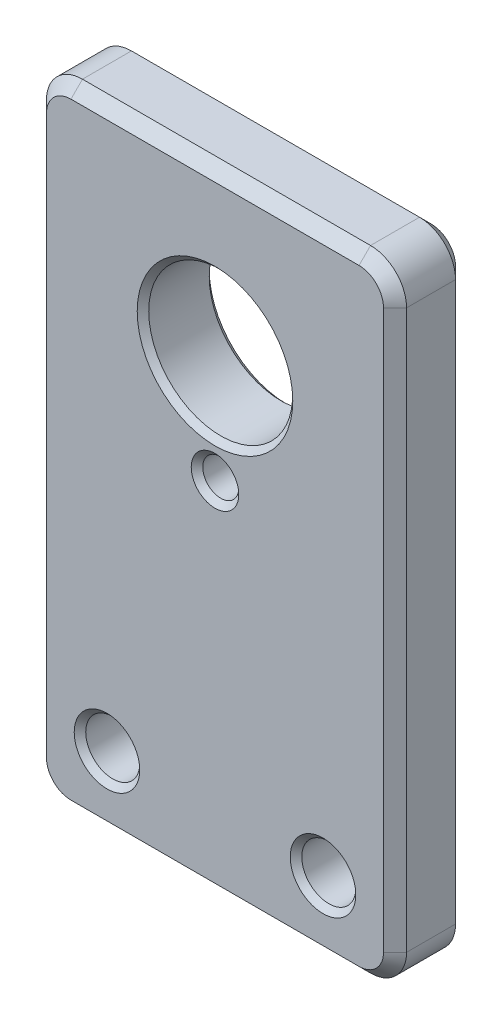
ISO-10303-21;
HEADER;
FILE_DESCRIPTION(('STEP AP214'),'2;1');
FILE_NAME('part.step','',(''),(''),'','','');
FILE_SCHEMA(('AUTOMOTIVE_DESIGN { 1 0 10303 214 1 1 1 1 }'));
ENDSEC;
DATA;
#1=APPLICATION_CONTEXT('core data for automotive mechanical design processes');
#2=APPLICATION_PROTOCOL_DEFINITION('international standard','automotive_design',2000,#1);
#3=PRODUCT_CONTEXT('',#1,'mechanical');
#4=PRODUCT('Part','Part','',(#3));
#5=PRODUCT_RELATED_PRODUCT_CATEGORY('part','',(#4));
#6=PRODUCT_DEFINITION_FORMATION('','',#4);
#7=PRODUCT_DEFINITION_CONTEXT('part definition',#1,'design');
#8=PRODUCT_DEFINITION('design','',#6,#7);
#9=PRODUCT_DEFINITION_SHAPE('','',#8);
#10=(LENGTH_UNIT() NAMED_UNIT(*) SI_UNIT(.MILLI.,.METRE.));
#11=(NAMED_UNIT(*) PLANE_ANGLE_UNIT() SI_UNIT($,.RADIAN.));
#12=(NAMED_UNIT(*) SI_UNIT($,.STERADIAN.) SOLID_ANGLE_UNIT());
#13=UNCERTAINTY_MEASURE_WITH_UNIT(LENGTH_MEASURE(1.E-05),#10,'distance_accuracy_value','');
#14=(GEOMETRIC_REPRESENTATION_CONTEXT(3) GLOBAL_UNCERTAINTY_ASSIGNED_CONTEXT((#13)) GLOBAL_UNIT_ASSIGNED_CONTEXT((#10,
#11,#12)) REPRESENTATION_CONTEXT('',''));
#15=CARTESIAN_POINT('',(0.,0.,0.));
#16=DIRECTION('',(0.,0.,1.));
#17=DIRECTION('',(1.,0.,0.));
#18=AXIS2_PLACEMENT_3D('',#15,#16,#17);
#19=CARTESIAN_POINT('',(-7.9375,-13.890625,1.5875));
#20=DIRECTION('',(-1.,0.,0.));
#21=DIRECTION('',(0.,0.,1.));
#22=AXIS2_PLACEMENT_3D('',#19,#20,#21);
#23=PLANE('',#22);
#24=DIRECTION('',(0.,0.,-1.));
#25=VECTOR('',#24,1.);
#26=CARTESIAN_POINT('',(-7.9375,12.303125,1.5875));
#27=LINE('',#26,#25);
#28=CARTESIAN_POINT('',(-7.9375,12.303125,1.0795));
#29=VERTEX_POINT('',#28);
#30=CARTESIAN_POINT('',(-7.9375,12.303125,-1.0795));
#31=VERTEX_POINT('',#30);
#32=EDGE_CURVE('E189',#29,#31,#27,.T.);
#33=ORIENTED_EDGE('',*,*,#32,.T.);
#34=DIRECTION('',(0.,-1.,0.));
#35=VECTOR('',#34,1.);
#36=CARTESIAN_POINT('',(-7.9375,-13.890625,-1.0795));
#37=LINE('',#36,#35);
#38=CARTESIAN_POINT('',(-7.9375,-12.303125,-1.0795));
#39=VERTEX_POINT('',#38);
#40=EDGE_CURVE('E227',#31,#39,#37,.T.);
#41=ORIENTED_EDGE('',*,*,#40,.T.);
#42=DIRECTION('',(0.,0.,-1.));
#43=VECTOR('',#42,1.);
#44=CARTESIAN_POINT('',(-7.9375,-12.303125,1.5875));
#45=LINE('',#44,#43);
#46=CARTESIAN_POINT('',(-7.9375,-12.303125,1.0795));
#47=VERTEX_POINT('',#46);
#48=EDGE_CURVE('E192',#39,#47,#45,.F.);
#49=ORIENTED_EDGE('',*,*,#48,.T.);
#50=DIRECTION('',(0.,1.,0.));
#51=VECTOR('',#50,1.);
#52=CARTESIAN_POINT('',(-7.9375,12.303125,1.0795));
#53=LINE('',#52,#51);
#54=EDGE_CURVE('E172',#47,#29,#53,.T.);
#55=ORIENTED_EDGE('',*,*,#54,.T.);
#56=EDGE_LOOP('',(#33,#41,#49,#55));
#57=FACE_BOUND('',#56,.T.);
#58=ADVANCED_FACE('F34',(#57),#23,.T.);
#59=CARTESIAN_POINT('',(-7.9375,-13.890625,1.5875));
#60=DIRECTION('',(0.,1.,0.));
#61=DIRECTION('',(0.,0.,1.));
#62=AXIS2_PLACEMENT_3D('',#59,#60,#61);
#63=PLANE('',#62);
#64=DIRECTION('',(0.,0.,-1.));
#65=VECTOR('',#64,1.);
#66=CARTESIAN_POINT('',(-6.35,-13.890625,-1.5875));
#67=LINE('',#66,#65);
#68=CARTESIAN_POINT('',(-6.35,-13.890625,1.0795));
#69=VERTEX_POINT('',#68);
#70=CARTESIAN_POINT('',(-6.35,-13.890625,-1.0795));
#71=VERTEX_POINT('',#70);
#72=EDGE_CURVE('E182',#69,#71,#67,.T.);
#73=ORIENTED_EDGE('',*,*,#72,.T.);
#74=DIRECTION('',(1.,0.,0.));
#75=VECTOR('',#74,1.);
#76=CARTESIAN_POINT('',(6.35,-13.890625,-1.0795));
#77=LINE('',#76,#75);
#78=CARTESIAN_POINT('',(6.35,-13.890625,-1.0795));
#79=VERTEX_POINT('',#78);
#80=EDGE_CURVE('E155',#71,#79,#77,.T.);
#81=ORIENTED_EDGE('',*,*,#80,.T.);
#82=DIRECTION('',(0.,0.,-1.));
#83=VECTOR('',#82,1.);
#84=CARTESIAN_POINT('',(6.35,-13.890625,1.5875));
#85=LINE('',#84,#83);
#86=CARTESIAN_POINT('',(6.35,-13.890625,1.0795));
#87=VERTEX_POINT('',#86);
#88=EDGE_CURVE('E180',#79,#87,#85,.F.);
#89=ORIENTED_EDGE('',*,*,#88,.T.);
#90=DIRECTION('',(-1.,0.,0.));
#91=VECTOR('',#90,1.);
#92=CARTESIAN_POINT('',(-7.9375,-13.890625,1.0795));
#93=LINE('',#92,#91);
#94=EDGE_CURVE('E185',#87,#69,#93,.T.);
#95=ORIENTED_EDGE('',*,*,#94,.T.);
#96=EDGE_LOOP('',(#73,#81,#89,#95));
#97=FACE_BOUND('',#96,.T.);
#98=ADVANCED_FACE('F178',(#97),#63,.F.);
#99=CARTESIAN_POINT('',(7.9375,-13.890625,1.5875));
#100=DIRECTION('',(-1.,0.,0.));
#101=DIRECTION('',(0.,0.,1.));
#102=AXIS2_PLACEMENT_3D('',#99,#100,#101);
#103=PLANE('',#102);
#104=DIRECTION('',(0.,0.,-1.));
#105=VECTOR('',#104,1.);
#106=CARTESIAN_POINT('',(7.9375,-12.303125,1.5875));
#107=LINE('',#106,#105);
#108=CARTESIAN_POINT('',(7.9375,-12.303125,1.0795));
#109=VERTEX_POINT('',#108);
#110=CARTESIAN_POINT('',(7.9375,-12.303125,-1.0795));
#111=VERTEX_POINT('',#110);
#112=EDGE_CURVE('E194',#109,#111,#107,.T.);
#113=ORIENTED_EDGE('',*,*,#112,.T.);
#114=DIRECTION('',(0.,1.,0.));
#115=VECTOR('',#114,1.);
#116=CARTESIAN_POINT('',(7.9375,12.303125,-1.0795));
#117=LINE('',#116,#115);
#118=CARTESIAN_POINT('',(7.9375,12.303125,-1.0795));
#119=VERTEX_POINT('',#118);
#120=EDGE_CURVE('E231',#111,#119,#117,.T.);
#121=ORIENTED_EDGE('',*,*,#120,.T.);
#122=DIRECTION('',(0.,0.,-1.));
#123=VECTOR('',#122,1.);
#124=CARTESIAN_POINT('',(7.9375,12.303125,1.5875));
#125=LINE('',#124,#123);
#126=CARTESIAN_POINT('',(7.9375,12.303125,1.0795));
#127=VERTEX_POINT('',#126);
#128=EDGE_CURVE('E278',#119,#127,#125,.F.);
#129=ORIENTED_EDGE('',*,*,#128,.T.);
#130=DIRECTION('',(0.,-1.,0.));
#131=VECTOR('',#130,1.);
#132=CARTESIAN_POINT('',(7.9375,-13.890625,1.0795));
#133=LINE('',#132,#131);
#134=EDGE_CURVE('E229',#127,#109,#133,.T.);
#135=ORIENTED_EDGE('',*,*,#134,.T.);
#136=EDGE_LOOP('',(#113,#121,#129,#135));
#137=FACE_BOUND('',#136,.T.);
#138=ADVANCED_FACE('F365',(#137),#103,.F.);
#139=CARTESIAN_POINT('',(-7.9375,13.890625,1.5875));
#140=DIRECTION('',(0.,1.,0.));
#141=DIRECTION('',(0.,0.,1.));
#142=AXIS2_PLACEMENT_3D('',#139,#140,#141);
#143=PLANE('',#142);
#144=DIRECTION('',(0.,0.,-1.));
#145=VECTOR('',#144,1.);
#146=CARTESIAN_POINT('',(6.35,13.890625,-1.5875));
#147=LINE('',#146,#145);
#148=CARTESIAN_POINT('',(6.35,13.890625,1.0795));
#149=VERTEX_POINT('',#148);
#150=CARTESIAN_POINT('',(6.35,13.890625,-1.0795));
#151=VERTEX_POINT('',#150);
#152=EDGE_CURVE('E200',#149,#151,#147,.T.);
#153=ORIENTED_EDGE('',*,*,#152,.T.);
#154=DIRECTION('',(-1.,0.,0.));
#155=VECTOR('',#154,1.);
#156=CARTESIAN_POINT('',(-7.9375,13.890625,-1.0795));
#157=LINE('',#156,#155);
#158=CARTESIAN_POINT('',(-6.35,13.890625,-1.0795));
#159=VERTEX_POINT('',#158);
#160=EDGE_CURVE('E243',#151,#159,#157,.T.);
#161=ORIENTED_EDGE('',*,*,#160,.T.);
#162=DIRECTION('',(0.,0.,-1.));
#163=VECTOR('',#162,1.);
#164=CARTESIAN_POINT('',(-6.35,13.890625,1.5875));
#165=LINE('',#164,#163);
#166=CARTESIAN_POINT('',(-6.35,13.890625,1.0795));
#167=VERTEX_POINT('',#166);
#168=EDGE_CURVE('E203',#159,#167,#165,.F.);
#169=ORIENTED_EDGE('',*,*,#168,.T.);
#170=DIRECTION('',(1.,0.,0.));
#171=VECTOR('',#170,1.);
#172=CARTESIAN_POINT('',(6.35,13.890625,1.0795));
#173=LINE('',#172,#171);
#174=EDGE_CURVE('E241',#167,#149,#173,.T.);
#175=ORIENTED_EDGE('',*,*,#174,.T.);
#176=EDGE_LOOP('',(#153,#161,#169,#175));
#177=FACE_BOUND('',#176,.T.);
#178=ADVANCED_FACE('F384',(#177),#143,.T.);
#179=CARTESIAN_POINT('',(0.,0.,1.5875));
#180=DIRECTION('',(0.,0.,-1.));
#181=DIRECTION('',(-1.,0.,0.));
#182=AXIS2_PLACEMENT_3D('',#179,#180,#181);
#183=PLANE('',#182);
#184=CARTESIAN_POINT('',(4.7625,-10.715625,1.5875));
#185=DIRECTION('',(0.,0.,-1.));
#186=DIRECTION('',(-1.,0.,0.));
#187=AXIS2_PLACEMENT_3D('',#184,#185,#186);
#188=CIRCLE('',#187,1.444625);
#189=CARTESIAN_POINT('',(3.317875,-10.715625,1.5875));
#190=VERTEX_POINT('',#189);
#191=EDGE_CURVE('E313',#190,#190,#188,.T.);
#192=ORIENTED_EDGE('',*,*,#191,.T.);
#193=EDGE_LOOP('',(#192));
#194=FACE_BOUND('',#193,.T.);
#195=CARTESIAN_POINT('',(-4.7625,-10.715625,1.5875));
#196=DIRECTION('',(0.,0.,-1.));
#197=DIRECTION('',(-1.,0.,0.));
#198=AXIS2_PLACEMENT_3D('',#195,#196,#197);
#199=CIRCLE('',#198,1.444625);
#200=CARTESIAN_POINT('',(-6.207125,-10.715625,1.5875));
#201=VERTEX_POINT('',#200);
#202=EDGE_CURVE('E310',#201,#201,#199,.T.);
#203=ORIENTED_EDGE('',*,*,#202,.T.);
#204=EDGE_LOOP('',(#203));
#205=FACE_BOUND('',#204,.T.);
#206=CARTESIAN_POINT('',(0.,1.984375,1.5875));
#207=DIRECTION('',(0.,0.,-1.));
#208=DIRECTION('',(-1.,0.,0.));
#209=AXIS2_PLACEMENT_3D('',#206,#207,#208);
#210=CIRCLE('',#209,1.04775);
#211=CARTESIAN_POINT('',(-1.04775,1.984375,1.5875));
#212=VERTEX_POINT('',#211);
#213=EDGE_CURVE('E307',#212,#212,#210,.T.);
#214=ORIENTED_EDGE('',*,*,#213,.T.);
#215=EDGE_LOOP('',(#214));
#216=FACE_BOUND('',#215,.T.);
#217=CARTESIAN_POINT('',(0.,6.746875,1.5875));
#218=DIRECTION('',(0.,0.,-1.));
#219=DIRECTION('',(-1.,0.,0.));
#220=AXIS2_PLACEMENT_3D('',#217,#218,#219);
#221=CIRCLE('',#220,3.42900000000001);
#222=CARTESIAN_POINT('',(-3.42900000000001,6.746875,1.5875));
#223=VERTEX_POINT('',#222);
#224=EDGE_CURVE('E304',#223,#223,#221,.T.);
#225=ORIENTED_EDGE('',*,*,#224,.T.);
#226=EDGE_LOOP('',(#225));
#227=FACE_BOUND('',#226,.T.);
#228=CARTESIAN_POINT('',(-6.35,-12.303125,1.5875));
#229=DIRECTION('',(0.,0.,-1.));
#230=DIRECTION('',(-1.,0.,0.));
#231=AXIS2_PLACEMENT_3D('',#228,#229,#230);
#232=CIRCLE('',#231,1.0795);
#233=CARTESIAN_POINT('',(-7.42950000000001,-12.303125,1.5875));
#234=VERTEX_POINT('',#233);
#235=CARTESIAN_POINT('',(-6.35,-13.382625,1.5875));
#236=VERTEX_POINT('',#235);
#237=EDGE_CURVE('E49',#234,#236,#232,.F.);
#238=ORIENTED_EDGE('',*,*,#237,.T.);
#239=DIRECTION('',(1.,0.,0.));
#240=VECTOR('',#239,1.);
#241=CARTESIAN_POINT('',(0.,-13.382625,1.5875));
#242=LINE('',#241,#240);
#243=CARTESIAN_POINT('',(6.35,-13.382625,1.5875));
#244=VERTEX_POINT('',#243);
#245=EDGE_CURVE('E258',#236,#244,#242,.T.);
#246=ORIENTED_EDGE('',*,*,#245,.T.);
#247=CARTESIAN_POINT('',(6.35,-12.303125,1.5875));
#248=DIRECTION('',(0.,0.,-1.));
#249=DIRECTION('',(-1.,0.,0.));
#250=AXIS2_PLACEMENT_3D('',#247,#248,#249);
#251=CIRCLE('',#250,1.0795);
#252=CARTESIAN_POINT('',(7.4295,-12.303125,1.5875));
#253=VERTEX_POINT('',#252);
#254=EDGE_CURVE('E255',#244,#253,#251,.F.);
#255=ORIENTED_EDGE('',*,*,#254,.T.);
#256=DIRECTION('',(0.,1.,0.));
#257=VECTOR('',#256,1.);
#258=CARTESIAN_POINT('',(7.4295,0.,1.5875));
#259=LINE('',#258,#257);
#260=CARTESIAN_POINT('',(7.4295,12.303125,1.5875));
#261=VERTEX_POINT('',#260);
#262=EDGE_CURVE('E251',#253,#261,#259,.T.);
#263=ORIENTED_EDGE('',*,*,#262,.T.);
#264=CARTESIAN_POINT('',(6.35,12.303125,1.5875));
#265=DIRECTION('',(0.,0.,-1.));
#266=DIRECTION('',(-1.,0.,0.));
#267=AXIS2_PLACEMENT_3D('',#264,#265,#266);
#268=CIRCLE('',#267,1.0795);
#269=CARTESIAN_POINT('',(6.35,13.382625,1.5875));
#270=VERTEX_POINT('',#269);
#271=EDGE_CURVE('E247',#261,#270,#268,.F.);
#272=ORIENTED_EDGE('',*,*,#271,.T.);
#273=DIRECTION('',(-1.,0.,0.));
#274=VECTOR('',#273,1.);
#275=CARTESIAN_POINT('',(-6.35,13.382625,1.5875));
#276=LINE('',#275,#274);
#277=CARTESIAN_POINT('',(-6.35,13.382625,1.5875));
#278=VERTEX_POINT('',#277);
#279=EDGE_CURVE('E245',#270,#278,#276,.T.);
#280=ORIENTED_EDGE('',*,*,#279,.T.);
#281=CARTESIAN_POINT('',(-6.35,12.303125,1.5875));
#282=DIRECTION('',(0.,0.,-1.));
#283=DIRECTION('',(-1.,0.,0.));
#284=AXIS2_PLACEMENT_3D('',#281,#282,#283);
#285=CIRCLE('',#284,1.0795);
#286=CARTESIAN_POINT('',(-7.42950000000001,12.303125,1.5875));
#287=VERTEX_POINT('',#286);
#288=EDGE_CURVE('E249',#278,#287,#285,.F.);
#289=ORIENTED_EDGE('',*,*,#288,.T.);
#290=DIRECTION('',(0.,-1.,0.));
#291=VECTOR('',#290,1.);
#292=CARTESIAN_POINT('',(-7.42950000000001,-12.303125,1.5875));
#293=LINE('',#292,#291);
#294=EDGE_CURVE('E253',#287,#234,#293,.T.);
#295=ORIENTED_EDGE('',*,*,#294,.T.);
#296=EDGE_LOOP('',(#238,#246,#255,#263,#272,#280,#289,#295));
#297=FACE_BOUND('',#296,.T.);
#298=ADVANCED_FACE('F353',(#194,#205,#216,#227,#297),#183,.F.);
#299=CARTESIAN_POINT('',(0.,0.,-1.5875));
#300=DIRECTION('',(0.,0.,-1.));
#301=DIRECTION('',(-1.,0.,0.));
#302=AXIS2_PLACEMENT_3D('',#299,#300,#301);
#303=PLANE('',#302);
#304=CARTESIAN_POINT('',(4.7625,-10.715625,-1.5875));
#305=DIRECTION('',(0.,0.,-1.));
#306=DIRECTION('',(-1.,0.,0.));
#307=AXIS2_PLACEMENT_3D('',#304,#305,#306);
#308=CIRCLE('',#307,1.444625);
#309=CARTESIAN_POINT('',(3.317875,-10.715625,-1.5875));
#310=VERTEX_POINT('',#309);
#311=EDGE_CURVE('E325',#310,#310,#308,.F.);
#312=ORIENTED_EDGE('',*,*,#311,.T.);
#313=EDGE_LOOP('',(#312));
#314=FACE_BOUND('',#313,.T.);
#315=CARTESIAN_POINT('',(-4.7625,-10.715625,-1.5875));
#316=DIRECTION('',(0.,0.,-1.));
#317=DIRECTION('',(-1.,0.,0.));
#318=AXIS2_PLACEMENT_3D('',#315,#316,#317);
#319=CIRCLE('',#318,1.444625);
#320=CARTESIAN_POINT('',(-6.207125,-10.715625,-1.5875));
#321=VERTEX_POINT('',#320);
#322=EDGE_CURVE('E322',#321,#321,#319,.F.);
#323=ORIENTED_EDGE('',*,*,#322,.T.);
#324=EDGE_LOOP('',(#323));
#325=FACE_BOUND('',#324,.T.);
#326=CARTESIAN_POINT('',(0.,1.984375,-1.5875));
#327=DIRECTION('',(0.,0.,-1.));
#328=DIRECTION('',(-1.,0.,0.));
#329=AXIS2_PLACEMENT_3D('',#326,#327,#328);
#330=CIRCLE('',#329,1.04774999999999);
#331=CARTESIAN_POINT('',(-1.04774999999999,1.984375,-1.5875));
#332=VERTEX_POINT('',#331);
#333=EDGE_CURVE('E319',#332,#332,#330,.F.);
#334=ORIENTED_EDGE('',*,*,#333,.T.);
#335=EDGE_LOOP('',(#334));
#336=FACE_BOUND('',#335,.T.);
#337=CARTESIAN_POINT('',(0.,6.746875,-1.5875));
#338=DIRECTION('',(0.,0.,-1.));
#339=DIRECTION('',(-1.,0.,0.));
#340=AXIS2_PLACEMENT_3D('',#337,#338,#339);
#341=CIRCLE('',#340,3.429);
#342=CARTESIAN_POINT('',(-3.429,6.746875,-1.5875));
#343=VERTEX_POINT('',#342);
#344=EDGE_CURVE('E316',#343,#343,#341,.F.);
#345=ORIENTED_EDGE('',*,*,#344,.T.);
#346=EDGE_LOOP('',(#345));
#347=FACE_BOUND('',#346,.T.);
#348=CARTESIAN_POINT('',(6.35,-12.303125,-1.5875));
#349=DIRECTION('',(0.,0.,-1.));
#350=DIRECTION('',(-1.,0.,0.));
#351=AXIS2_PLACEMENT_3D('',#348,#349,#350);
#352=CIRCLE('',#351,1.0795);
#353=CARTESIAN_POINT('',(7.4295,-12.303125,-1.5875));
#354=VERTEX_POINT('',#353);
#355=CARTESIAN_POINT('',(6.35,-13.382625,-1.5875));
#356=VERTEX_POINT('',#355);
#357=EDGE_CURVE('E216',#354,#356,#352,.T.);
#358=ORIENTED_EDGE('',*,*,#357,.T.);
#359=DIRECTION('',(-1.,0.,0.));
#360=VECTOR('',#359,1.);
#361=CARTESIAN_POINT('',(-6.35,-13.382625,-1.5875));
#362=LINE('',#361,#360);
#363=CARTESIAN_POINT('',(-6.35,-13.382625,-1.5875));
#364=VERTEX_POINT('',#363);
#365=EDGE_CURVE('E157',#356,#364,#362,.T.);
#366=ORIENTED_EDGE('',*,*,#365,.T.);
#367=CARTESIAN_POINT('',(-6.35,-12.303125,-1.5875));
#368=DIRECTION('',(0.,0.,-1.));
#369=DIRECTION('',(-1.,0.,0.));
#370=AXIS2_PLACEMENT_3D('',#367,#368,#369);
#371=CIRCLE('',#370,1.0795);
#372=CARTESIAN_POINT('',(-7.42950000000001,-12.303125,-1.5875));
#373=VERTEX_POINT('',#372);
#374=EDGE_CURVE('E218',#364,#373,#371,.T.);
#375=ORIENTED_EDGE('',*,*,#374,.T.);
#376=DIRECTION('',(0.,1.,0.));
#377=VECTOR('',#376,1.);
#378=CARTESIAN_POINT('',(-7.42950000000001,0.,-1.5875));
#379=LINE('',#378,#377);
#380=CARTESIAN_POINT('',(-7.42950000000001,12.303125,-1.5875));
#381=VERTEX_POINT('',#380);
#382=EDGE_CURVE('E214',#373,#381,#379,.T.);
#383=ORIENTED_EDGE('',*,*,#382,.T.);
#384=CARTESIAN_POINT('',(-6.35,12.303125,-1.5875));
#385=DIRECTION('',(0.,0.,-1.));
#386=DIRECTION('',(-1.,0.,0.));
#387=AXIS2_PLACEMENT_3D('',#384,#385,#386);
#388=CIRCLE('',#387,1.0795);
#389=CARTESIAN_POINT('',(-6.35,13.382625,-1.5875));
#390=VERTEX_POINT('',#389);
#391=EDGE_CURVE('E210',#381,#390,#388,.T.);
#392=ORIENTED_EDGE('',*,*,#391,.T.);
#393=DIRECTION('',(1.,0.,0.));
#394=VECTOR('',#393,1.);
#395=CARTESIAN_POINT('',(0.,13.382625,-1.5875));
#396=LINE('',#395,#394);
#397=CARTESIAN_POINT('',(6.35,13.382625,-1.5875));
#398=VERTEX_POINT('',#397);
#399=EDGE_CURVE('E184',#390,#398,#396,.T.);
#400=ORIENTED_EDGE('',*,*,#399,.T.);
#401=CARTESIAN_POINT('',(6.35,12.303125,-1.5875));
#402=DIRECTION('',(0.,0.,-1.));
#403=DIRECTION('',(-1.,0.,0.));
#404=AXIS2_PLACEMENT_3D('',#401,#402,#403);
#405=CIRCLE('',#404,1.0795);
#406=CARTESIAN_POINT('',(7.4295,12.303125,-1.5875));
#407=VERTEX_POINT('',#406);
#408=EDGE_CURVE('E208',#398,#407,#405,.T.);
#409=ORIENTED_EDGE('',*,*,#408,.T.);
#410=DIRECTION('',(0.,-1.,0.));
#411=VECTOR('',#410,1.);
#412=CARTESIAN_POINT('',(7.4295,-12.303125,-1.5875));
#413=LINE('',#412,#411);
#414=EDGE_CURVE('E212',#407,#354,#413,.T.);
#415=ORIENTED_EDGE('',*,*,#414,.T.);
#416=EDGE_LOOP('',(#358,#366,#375,#383,#392,#400,#409,#415));
#417=FACE_BOUND('',#416,.T.);
#418=ADVANCED_FACE('F349',(#314,#325,#336,#347,#417),#303,.T.);
#419=CARTESIAN_POINT('',(4.7625,-10.715625,1.5875));
#420=DIRECTION('',(0.,0.,1.));
#421=DIRECTION('',(1.,0.,0.));
#422=AXIS2_PLACEMENT_3D('',#419,#420,#421);
#423=CYLINDRICAL_SURFACE('',#422,1.190625);
#424=CARTESIAN_POINT('',(4.7625,-10.715625,1.3335));
#425=DIRECTION('',(0.,0.,-1.));
#426=DIRECTION('',(-1.,0.,0.));
#427=AXIS2_PLACEMENT_3D('',#424,#425,#426);
#428=CIRCLE('',#427,1.190625);
#429=CARTESIAN_POINT('',(3.571875,-10.715625,1.3335));
#430=VERTEX_POINT('',#429);
#431=EDGE_CURVE('E301',#430,#430,#428,.F.);
#432=ORIENTED_EDGE('',*,*,#431,.T.);
#433=EDGE_LOOP('',(#432));
#434=FACE_BOUND('',#433,.T.);
#435=CARTESIAN_POINT('',(4.7625,-10.715625,-1.3335));
#436=DIRECTION('',(0.,0.,-1.));
#437=DIRECTION('',(-1.,0.,0.));
#438=AXIS2_PLACEMENT_3D('',#435,#436,#437);
#439=CIRCLE('',#438,1.190625);
#440=CARTESIAN_POINT('',(3.571875,-10.715625,-1.3335));
#441=VERTEX_POINT('',#440);
#442=EDGE_CURVE('E259',#441,#441,#439,.T.);
#443=ORIENTED_EDGE('',*,*,#442,.T.);
#444=EDGE_LOOP('',(#443));
#445=FACE_BOUND('',#444,.T.);
#446=ADVANCED_FACE('F352',(#434,#445),#423,.F.);
#447=CARTESIAN_POINT('',(-4.7625,-10.715625,1.5875));
#448=DIRECTION('',(0.,0.,1.));
#449=DIRECTION('',(1.,0.,0.));
#450=AXIS2_PLACEMENT_3D('',#447,#448,#449);
#451=CYLINDRICAL_SURFACE('',#450,1.190625);
#452=CARTESIAN_POINT('',(-4.7625,-10.715625,1.3335));
#453=DIRECTION('',(0.,0.,-1.));
#454=DIRECTION('',(-1.,0.,0.));
#455=AXIS2_PLACEMENT_3D('',#452,#453,#454);
#456=CIRCLE('',#455,1.190625);
#457=CARTESIAN_POINT('',(-5.953125,-10.715625,1.3335));
#458=VERTEX_POINT('',#457);
#459=EDGE_CURVE('E331',#458,#458,#456,.F.);
#460=ORIENTED_EDGE('',*,*,#459,.T.);
#461=EDGE_LOOP('',(#460));
#462=FACE_BOUND('',#461,.T.);
#463=CARTESIAN_POINT('',(-4.7625,-10.715625,-1.3335));
#464=DIRECTION('',(0.,0.,-1.));
#465=DIRECTION('',(-1.,0.,0.));
#466=AXIS2_PLACEMENT_3D('',#463,#464,#465);
#467=CIRCLE('',#466,1.190625);
#468=CARTESIAN_POINT('',(-5.953125,-10.715625,-1.3335));
#469=VERTEX_POINT('',#468);
#470=EDGE_CURVE('E328',#469,#469,#467,.T.);
#471=ORIENTED_EDGE('',*,*,#470,.T.);
#472=EDGE_LOOP('',(#471));
#473=FACE_BOUND('',#472,.T.);
#474=ADVANCED_FACE('F689',(#462,#473),#451,.F.);
#475=CARTESIAN_POINT('',(0.,6.746875,1.5875));
#476=DIRECTION('',(0.,0.,1.));
#477=DIRECTION('',(1.,0.,0.));
#478=AXIS2_PLACEMENT_3D('',#475,#476,#477);
#479=CYLINDRICAL_SURFACE('',#478,3.175);
#480=CARTESIAN_POINT('',(0.,6.746875,1.33349999999999));
#481=DIRECTION('',(0.,0.,-1.));
#482=DIRECTION('',(-1.,0.,0.));
#483=AXIS2_PLACEMENT_3D('',#480,#481,#482);
#484=CIRCLE('',#483,3.175);
#485=CARTESIAN_POINT('',(-3.175,6.746875,1.33349999999999));
#486=VERTEX_POINT('',#485);
#487=EDGE_CURVE('E11',#486,#486,#484,.F.);
#488=ORIENTED_EDGE('',*,*,#487,.T.);
#489=EDGE_LOOP('',(#488));
#490=FACE_BOUND('',#489,.T.);
#491=CARTESIAN_POINT('',(0.,6.746875,-1.3335));
#492=DIRECTION('',(0.,0.,-1.));
#493=DIRECTION('',(-1.,0.,0.));
#494=AXIS2_PLACEMENT_3D('',#491,#492,#493);
#495=CIRCLE('',#494,3.175);
#496=CARTESIAN_POINT('',(-3.175,6.746875,-1.3335));
#497=VERTEX_POINT('',#496);
#498=EDGE_CURVE('E42',#497,#497,#495,.T.);
#499=ORIENTED_EDGE('',*,*,#498,.T.);
#500=EDGE_LOOP('',(#499));
#501=FACE_BOUND('',#500,.T.);
#502=ADVANCED_FACE('F342',(#490,#501),#479,.F.);
#503=CARTESIAN_POINT('',(0.,1.984375,1.5875));
#504=DIRECTION('',(0.,0.,1.));
#505=DIRECTION('',(1.,0.,0.));
#506=AXIS2_PLACEMENT_3D('',#503,#504,#505);
#507=CYLINDRICAL_SURFACE('',#506,0.793749999999999);
#508=CARTESIAN_POINT('',(0.,1.984375,1.3335));
#509=DIRECTION('',(0.,0.,-1.));
#510=DIRECTION('',(-1.,0.,0.));
#511=AXIS2_PLACEMENT_3D('',#508,#509,#510);
#512=CIRCLE('',#511,0.793749999999999);
#513=CARTESIAN_POINT('',(-0.793749999999999,1.984375,1.3335));
#514=VERTEX_POINT('',#513);
#515=EDGE_CURVE('E337',#514,#514,#512,.F.);
#516=ORIENTED_EDGE('',*,*,#515,.T.);
#517=EDGE_LOOP('',(#516));
#518=FACE_BOUND('',#517,.T.);
#519=CARTESIAN_POINT('',(0.,1.984375,-1.33350000000001));
#520=DIRECTION('',(0.,0.,-1.));
#521=DIRECTION('',(-1.,0.,0.));
#522=AXIS2_PLACEMENT_3D('',#519,#520,#521);
#523=CIRCLE('',#522,0.793749999999999);
#524=CARTESIAN_POINT('',(-0.793749999999999,1.984375,-1.33350000000001));
#525=VERTEX_POINT('',#524);
#526=EDGE_CURVE('E334',#525,#525,#523,.T.);
#527=ORIENTED_EDGE('',*,*,#526,.T.);
#528=EDGE_LOOP('',(#527));
#529=FACE_BOUND('',#528,.T.);
#530=ADVANCED_FACE('F454',(#518,#529),#507,.F.);
#531=CARTESIAN_POINT('',(6.35,-12.303125,1.5875));
#532=DIRECTION('',(0.,0.,-1.));
#533=DIRECTION('',(-1.,0.,0.));
#534=AXIS2_PLACEMENT_3D('',#531,#532,#533);
#535=CYLINDRICAL_SURFACE('',#534,1.5875);
#536=ORIENTED_EDGE('',*,*,#88,.F.);
#537=CARTESIAN_POINT('',(6.35,-12.303125,-1.0795));
#538=DIRECTION('',(0.,0.,-1.));
#539=DIRECTION('',(-1.,0.,0.));
#540=AXIS2_PLACEMENT_3D('',#537,#538,#539);
#541=CIRCLE('',#540,1.5875);
#542=EDGE_CURVE('E164',#79,#111,#541,.F.);
#543=ORIENTED_EDGE('',*,*,#542,.T.);
#544=ORIENTED_EDGE('',*,*,#112,.F.);
#545=CARTESIAN_POINT('',(6.35,-12.303125,1.0795));
#546=DIRECTION('',(0.,0.,-1.));
#547=DIRECTION('',(-1.,0.,0.));
#548=AXIS2_PLACEMENT_3D('',#545,#546,#547);
#549=CIRCLE('',#548,1.5875);
#550=EDGE_CURVE('E173',#109,#87,#549,.T.);
#551=ORIENTED_EDGE('',*,*,#550,.T.);
#552=EDGE_LOOP('',(#536,#543,#544,#551));
#553=FACE_BOUND('',#552,.T.);
#554=ADVANCED_FACE('F187',(#553),#535,.T.);
#555=CARTESIAN_POINT('',(-6.35,-12.303125,1.5875));
#556=DIRECTION('',(0.,0.,1.));
#557=DIRECTION('',(1.,0.,0.));
#558=AXIS2_PLACEMENT_3D('',#555,#556,#557);
#559=CYLINDRICAL_SURFACE('',#558,1.5875);
#560=ORIENTED_EDGE('',*,*,#48,.F.);
#561=CARTESIAN_POINT('',(-6.35,-12.303125,-1.0795));
#562=DIRECTION('',(0.,0.,-1.));
#563=DIRECTION('',(-1.,0.,0.));
#564=AXIS2_PLACEMENT_3D('',#561,#562,#563);
#565=CIRCLE('',#564,1.5875);
#566=EDGE_CURVE('E223',#39,#71,#565,.F.);
#567=ORIENTED_EDGE('',*,*,#566,.T.);
#568=ORIENTED_EDGE('',*,*,#72,.F.);
#569=CARTESIAN_POINT('',(-6.35,-12.303125,1.0795));
#570=DIRECTION('',(0.,0.,-1.));
#571=DIRECTION('',(-1.,0.,0.));
#572=AXIS2_PLACEMENT_3D('',#569,#570,#571);
#573=CIRCLE('',#572,1.5875);
#574=EDGE_CURVE('E221',#69,#47,#573,.T.);
#575=ORIENTED_EDGE('',*,*,#574,.T.);
#576=EDGE_LOOP('',(#560,#567,#568,#575));
#577=FACE_BOUND('',#576,.T.);
#578=ADVANCED_FACE('F420',(#577),#559,.T.);
#579=CARTESIAN_POINT('',(-6.35,12.303125,1.5875));
#580=DIRECTION('',(0.,0.,-1.));
#581=DIRECTION('',(-1.,0.,0.));
#582=AXIS2_PLACEMENT_3D('',#579,#580,#581);
#583=CYLINDRICAL_SURFACE('',#582,1.5875);
#584=ORIENTED_EDGE('',*,*,#168,.F.);
#585=CARTESIAN_POINT('',(-6.35,12.303125,-1.0795));
#586=DIRECTION('',(0.,0.,-1.));
#587=DIRECTION('',(-1.,0.,0.));
#588=AXIS2_PLACEMENT_3D('',#585,#586,#587);
#589=CIRCLE('',#588,1.5875);
#590=EDGE_CURVE('E235',#159,#31,#589,.F.);
#591=ORIENTED_EDGE('',*,*,#590,.T.);
#592=ORIENTED_EDGE('',*,*,#32,.F.);
#593=CARTESIAN_POINT('',(-6.35,12.303125,1.0795));
#594=DIRECTION('',(0.,0.,-1.));
#595=DIRECTION('',(-1.,0.,0.));
#596=AXIS2_PLACEMENT_3D('',#593,#594,#595);
#597=CIRCLE('',#596,1.5875);
#598=EDGE_CURVE('E233',#29,#167,#597,.T.);
#599=ORIENTED_EDGE('',*,*,#598,.T.);
#600=EDGE_LOOP('',(#584,#591,#592,#599));
#601=FACE_BOUND('',#600,.T.);
#602=ADVANCED_FACE('F387',(#601),#583,.T.);
#603=CARTESIAN_POINT('',(6.35,12.303125,1.5875));
#604=DIRECTION('',(0.,0.,1.));
#605=DIRECTION('',(1.,0.,0.));
#606=AXIS2_PLACEMENT_3D('',#603,#604,#605);
#607=CYLINDRICAL_SURFACE('',#606,1.5875);
#608=ORIENTED_EDGE('',*,*,#128,.F.);
#609=CARTESIAN_POINT('',(6.35,12.303125,-1.0795));
#610=DIRECTION('',(0.,0.,-1.));
#611=DIRECTION('',(-1.,0.,0.));
#612=AXIS2_PLACEMENT_3D('',#609,#610,#611);
#613=CIRCLE('',#612,1.5875);
#614=EDGE_CURVE('E239',#119,#151,#613,.F.);
#615=ORIENTED_EDGE('',*,*,#614,.T.);
#616=ORIENTED_EDGE('',*,*,#152,.F.);
#617=CARTESIAN_POINT('',(6.35,12.303125,1.0795));
#618=DIRECTION('',(0.,0.,-1.));
#619=DIRECTION('',(-1.,0.,0.));
#620=AXIS2_PLACEMENT_3D('',#617,#618,#619);
#621=CIRCLE('',#620,1.5875);
#622=EDGE_CURVE('E237',#149,#127,#621,.T.);
#623=ORIENTED_EDGE('',*,*,#622,.T.);
#624=EDGE_LOOP('',(#608,#615,#616,#623));
#625=FACE_BOUND('',#624,.T.);
#626=ADVANCED_FACE('F369',(#625),#607,.T.);
#627=CARTESIAN_POINT('',(0.,13.382625,-1.5875));
#628=DIRECTION('',(0.,-0.707106781186548,0.707106781186548));
#629=DIRECTION('',(1.,0.,0.));
#630=AXIS2_PLACEMENT_3D('',#627,#628,#629);
#631=PLANE('',#630);
#632=DIRECTION('',(0.,0.707106781186548,0.707106781186548));
#633=VECTOR('',#632,1.);
#634=CARTESIAN_POINT('',(6.35,13.382625,-1.5875));
#635=LINE('',#634,#633);
#636=EDGE_CURVE('E272',#398,#151,#635,.T.);
#637=ORIENTED_EDGE('',*,*,#636,.F.);
#638=ORIENTED_EDGE('',*,*,#399,.F.);
#639=DIRECTION('',(0.,-0.707106781186548,-0.707106781186548));
#640=VECTOR('',#639,1.);
#641=CARTESIAN_POINT('',(-6.35,13.890625,-1.0795));
#642=LINE('',#641,#640);
#643=EDGE_CURVE('E275',#159,#390,#642,.T.);
#644=ORIENTED_EDGE('',*,*,#643,.F.);
#645=ORIENTED_EDGE('',*,*,#160,.F.);
#646=EDGE_LOOP('',(#637,#638,#644,#645));
#647=FACE_BOUND('',#646,.T.);
#648=ADVANCED_FACE('F379',(#647),#631,.F.);
#649=CARTESIAN_POINT('',(-6.35,12.303125,-1.5875));
#650=DIRECTION('',(0.,0.,1.));
#651=DIRECTION('',(1.,0.,0.));
#652=AXIS2_PLACEMENT_3D('',#649,#650,#651);
#653=CONICAL_SURFACE('',#652,1.0795,0.785398163397448);
#654=ORIENTED_EDGE('',*,*,#643,.T.);
#655=ORIENTED_EDGE('',*,*,#391,.F.);
#656=DIRECTION('',(0.707106781186548,0.,-0.707106781186548));
#657=VECTOR('',#656,1.);
#658=CARTESIAN_POINT('',(-7.9375,12.303125,-1.0795));
#659=LINE('',#658,#657);
#660=EDGE_CURVE('E269',#31,#381,#659,.T.);
#661=ORIENTED_EDGE('',*,*,#660,.F.);
#662=ORIENTED_EDGE('',*,*,#590,.F.);
#663=EDGE_LOOP('',(#654,#655,#661,#662));
#664=FACE_BOUND('',#663,.T.);
#665=ADVANCED_FACE('F433',(#664),#653,.T.);
#666=CARTESIAN_POINT('',(6.35,12.303125,-1.5875));
#667=DIRECTION('',(0.,0.,1.));
#668=DIRECTION('',(1.,0.,0.));
#669=AXIS2_PLACEMENT_3D('',#666,#667,#668);
#670=CONICAL_SURFACE('',#669,1.0795,0.785398163397448);
#671=ORIENTED_EDGE('',*,*,#636,.T.);
#672=ORIENTED_EDGE('',*,*,#614,.F.);
#673=DIRECTION('',(0.707106781186548,0.,0.707106781186548));
#674=VECTOR('',#673,1.);
#675=CARTESIAN_POINT('',(7.4295,12.303125,-1.5875));
#676=LINE('',#675,#674);
#677=EDGE_CURVE('E266',#407,#119,#676,.T.);
#678=ORIENTED_EDGE('',*,*,#677,.F.);
#679=ORIENTED_EDGE('',*,*,#408,.F.);
#680=EDGE_LOOP('',(#671,#672,#678,#679));
#681=FACE_BOUND('',#680,.T.);
#682=ADVANCED_FACE('F374',(#681),#670,.T.);
#683=CARTESIAN_POINT('',(-7.42950000000001,0.,-1.5875));
#684=DIRECTION('',(0.707106781186548,0.,0.707106781186548));
#685=DIRECTION('',(0.,1.,0.));
#686=AXIS2_PLACEMENT_3D('',#683,#684,#685);
#687=PLANE('',#686);
#688=ORIENTED_EDGE('',*,*,#660,.T.);
#689=ORIENTED_EDGE('',*,*,#382,.F.);
#690=DIRECTION('',(0.707106781186548,0.,-0.707106781186548));
#691=VECTOR('',#690,1.);
#692=CARTESIAN_POINT('',(-7.9375,-12.303125,-1.0795));
#693=LINE('',#692,#691);
#694=EDGE_CURVE('E263',#39,#373,#693,.T.);
#695=ORIENTED_EDGE('',*,*,#694,.F.);
#696=ORIENTED_EDGE('',*,*,#40,.F.);
#697=EDGE_LOOP('',(#688,#689,#695,#696));
#698=FACE_BOUND('',#697,.T.);
#699=ADVANCED_FACE('F429',(#698),#687,.F.);
#700=CARTESIAN_POINT('',(7.9375,-13.890625,-1.0795));
#701=DIRECTION('',(0.707106781186548,0.,-0.707106781186548));
#702=DIRECTION('',(0.,-1.,0.));
#703=AXIS2_PLACEMENT_3D('',#700,#701,#702);
#704=PLANE('',#703);
#705=ORIENTED_EDGE('',*,*,#677,.T.);
#706=ORIENTED_EDGE('',*,*,#120,.F.);
#707=DIRECTION('',(0.707106781186548,0.,0.707106781186548));
#708=VECTOR('',#707,1.);
#709=CARTESIAN_POINT('',(7.4295,-12.303125,-1.5875));
#710=LINE('',#709,#708);
#711=EDGE_CURVE('E167',#354,#111,#710,.T.);
#712=ORIENTED_EDGE('',*,*,#711,.F.);
#713=ORIENTED_EDGE('',*,*,#414,.F.);
#714=EDGE_LOOP('',(#705,#706,#712,#713));
#715=FACE_BOUND('',#714,.T.);
#716=ADVANCED_FACE('F361',(#715),#704,.T.);
#717=CARTESIAN_POINT('',(-6.35,-12.303125,-1.5875));
#718=DIRECTION('',(0.,0.,1.));
#719=DIRECTION('',(1.,0.,0.));
#720=AXIS2_PLACEMENT_3D('',#717,#718,#719);
#721=CONICAL_SURFACE('',#720,1.0795,0.785398163397448);
#722=ORIENTED_EDGE('',*,*,#694,.T.);
#723=ORIENTED_EDGE('',*,*,#374,.F.);
#724=DIRECTION('',(0.,0.707106781186548,-0.707106781186548));
#725=VECTOR('',#724,1.);
#726=CARTESIAN_POINT('',(-6.35,-13.890625,-1.0795));
#727=LINE('',#726,#725);
#728=EDGE_CURVE('E160',#71,#364,#727,.T.);
#729=ORIENTED_EDGE('',*,*,#728,.F.);
#730=ORIENTED_EDGE('',*,*,#566,.F.);
#731=EDGE_LOOP('',(#722,#723,#729,#730));
#732=FACE_BOUND('',#731,.T.);
#733=ADVANCED_FACE('F424',(#732),#721,.T.);
#734=CARTESIAN_POINT('',(6.35,-12.303125,-1.5875));
#735=DIRECTION('',(0.,0.,1.));
#736=DIRECTION('',(1.,0.,0.));
#737=AXIS2_PLACEMENT_3D('',#734,#735,#736);
#738=CONICAL_SURFACE('',#737,1.0795,0.785398163397448);
#739=ORIENTED_EDGE('',*,*,#711,.T.);
#740=ORIENTED_EDGE('',*,*,#542,.F.);
#741=DIRECTION('',(0.,-0.707106781186548,0.707106781186548));
#742=VECTOR('',#741,1.);
#743=CARTESIAN_POINT('',(6.35,-13.382625,-1.5875));
#744=LINE('',#743,#742);
#745=EDGE_CURVE('E151',#356,#79,#744,.T.);
#746=ORIENTED_EDGE('',*,*,#745,.F.);
#747=ORIENTED_EDGE('',*,*,#357,.F.);
#748=EDGE_LOOP('',(#739,#740,#746,#747));
#749=FACE_BOUND('',#748,.T.);
#750=ADVANCED_FACE('F165',(#749),#738,.T.);
#751=CARTESIAN_POINT('',(-7.9375,-13.890625,-1.0795));
#752=DIRECTION('',(0.,-0.707106781186548,-0.707106781186548));
#753=DIRECTION('',(-1.,0.,0.));
#754=AXIS2_PLACEMENT_3D('',#751,#752,#753);
#755=PLANE('',#754);
#756=ORIENTED_EDGE('',*,*,#728,.T.);
#757=ORIENTED_EDGE('',*,*,#365,.F.);
#758=ORIENTED_EDGE('',*,*,#745,.T.);
#759=ORIENTED_EDGE('',*,*,#80,.F.);
#760=EDGE_LOOP('',(#756,#757,#758,#759));
#761=FACE_BOUND('',#760,.T.);
#762=ADVANCED_FACE('F153',(#761),#755,.T.);
#763=CARTESIAN_POINT('',(-7.9375,13.890625,1.0795));
#764=DIRECTION('',(0.,0.707106781186548,0.707106781186548));
#765=DIRECTION('',(-1.,0.,0.));
#766=AXIS2_PLACEMENT_3D('',#763,#764,#765);
#767=PLANE('',#766);
#768=DIRECTION('',(0.,-0.707106781186548,0.707106781186548));
#769=VECTOR('',#768,1.);
#770=CARTESIAN_POINT('',(6.35,13.890625,1.0795));
#771=LINE('',#770,#769);
#772=EDGE_CURVE('E294',#149,#270,#771,.T.);
#773=ORIENTED_EDGE('',*,*,#772,.F.);
#774=ORIENTED_EDGE('',*,*,#174,.F.);
#775=DIRECTION('',(0.,0.707106781186548,-0.707106781186548));
#776=VECTOR('',#775,1.);
#777=CARTESIAN_POINT('',(-6.35,13.382625,1.5875));
#778=LINE('',#777,#776);
#779=EDGE_CURVE('E161',#278,#167,#778,.T.);
#780=ORIENTED_EDGE('',*,*,#779,.F.);
#781=ORIENTED_EDGE('',*,*,#279,.F.);
#782=EDGE_LOOP('',(#773,#774,#780,#781));
#783=FACE_BOUND('',#782,.T.);
#784=ADVANCED_FACE('F404',(#783),#767,.T.);
#785=CARTESIAN_POINT('',(-6.35,12.303125,1.5875));
#786=DIRECTION('',(0.,0.,-1.));
#787=DIRECTION('',(-1.,0.,0.));
#788=AXIS2_PLACEMENT_3D('',#785,#786,#787);
#789=CONICAL_SURFACE('',#788,1.0795,0.785398163397448);
#790=ORIENTED_EDGE('',*,*,#779,.T.);
#791=ORIENTED_EDGE('',*,*,#598,.F.);
#792=DIRECTION('',(-0.707106781186548,0.,-0.707106781186548));
#793=VECTOR('',#792,1.);
#794=CARTESIAN_POINT('',(-7.42950000000001,12.303125,1.5875));
#795=LINE('',#794,#793);
#796=EDGE_CURVE('E291',#287,#29,#795,.T.);
#797=ORIENTED_EDGE('',*,*,#796,.F.);
#798=ORIENTED_EDGE('',*,*,#288,.F.);
#799=EDGE_LOOP('',(#790,#791,#797,#798));
#800=FACE_BOUND('',#799,.T.);
#801=ADVANCED_FACE('F392',(#800),#789,.T.);
#802=CARTESIAN_POINT('',(6.35,12.303125,1.5875));
#803=DIRECTION('',(0.,0.,-1.));
#804=DIRECTION('',(-1.,0.,0.));
#805=AXIS2_PLACEMENT_3D('',#802,#803,#804);
#806=CONICAL_SURFACE('',#805,1.0795,0.785398163397448);
#807=ORIENTED_EDGE('',*,*,#772,.T.);
#808=ORIENTED_EDGE('',*,*,#271,.F.);
#809=DIRECTION('',(-0.707106781186548,0.,0.707106781186548));
#810=VECTOR('',#809,1.);
#811=CARTESIAN_POINT('',(7.9375,12.303125,1.0795));
#812=LINE('',#811,#810);
#813=EDGE_CURVE('E288',#127,#261,#812,.T.);
#814=ORIENTED_EDGE('',*,*,#813,.F.);
#815=ORIENTED_EDGE('',*,*,#622,.F.);
#816=EDGE_LOOP('',(#807,#808,#814,#815));
#817=FACE_BOUND('',#816,.T.);
#818=ADVANCED_FACE('F406',(#817),#806,.T.);
#819=CARTESIAN_POINT('',(-7.9375,-13.890625,1.0795));
#820=DIRECTION('',(-0.707106781186548,0.,0.707106781186548));
#821=DIRECTION('',(0.,-1.,0.));
#822=AXIS2_PLACEMENT_3D('',#819,#820,#821);
#823=PLANE('',#822);
#824=ORIENTED_EDGE('',*,*,#796,.T.);
#825=ORIENTED_EDGE('',*,*,#54,.F.);
#826=DIRECTION('',(-0.707106781186548,0.,-0.707106781186548));
#827=VECTOR('',#826,1.);
#828=CARTESIAN_POINT('',(-7.42950000000001,-12.303125,1.5875));
#829=LINE('',#828,#827);
#830=EDGE_CURVE('E285',#234,#47,#829,.T.);
#831=ORIENTED_EDGE('',*,*,#830,.F.);
#832=ORIENTED_EDGE('',*,*,#294,.F.);
#833=EDGE_LOOP('',(#824,#825,#831,#832));
#834=FACE_BOUND('',#833,.T.);
#835=ADVANCED_FACE('F398',(#834),#823,.T.);
#836=CARTESIAN_POINT('',(7.4295,0.,1.5875));
#837=DIRECTION('',(-0.707106781186548,0.,-0.707106781186548));
#838=DIRECTION('',(0.,1.,0.));
#839=AXIS2_PLACEMENT_3D('',#836,#837,#838);
#840=PLANE('',#839);
#841=ORIENTED_EDGE('',*,*,#813,.T.);
#842=ORIENTED_EDGE('',*,*,#262,.F.);
#843=DIRECTION('',(-0.707106781186548,0.,0.707106781186548));
#844=VECTOR('',#843,1.);
#845=CARTESIAN_POINT('',(7.9375,-12.303125,1.0795));
#846=LINE('',#845,#844);
#847=EDGE_CURVE('E282',#109,#253,#846,.T.);
#848=ORIENTED_EDGE('',*,*,#847,.F.);
#849=ORIENTED_EDGE('',*,*,#134,.F.);
#850=EDGE_LOOP('',(#841,#842,#848,#849));
#851=FACE_BOUND('',#850,.T.);
#852=ADVANCED_FACE('F411',(#851),#840,.F.);
#853=CARTESIAN_POINT('',(-6.35,-12.303125,1.5875));
#854=DIRECTION('',(0.,0.,-1.));
#855=DIRECTION('',(-1.,0.,0.));
#856=AXIS2_PLACEMENT_3D('',#853,#854,#855);
#857=CONICAL_SURFACE('',#856,1.0795,0.785398163397448);
#858=ORIENTED_EDGE('',*,*,#830,.T.);
#859=ORIENTED_EDGE('',*,*,#574,.F.);
#860=DIRECTION('',(0.,-0.707106781186548,-0.707106781186548));
#861=VECTOR('',#860,1.);
#862=CARTESIAN_POINT('',(-6.35,-13.382625,1.5875));
#863=LINE('',#862,#861);
#864=EDGE_CURVE('E280',#236,#69,#863,.T.);
#865=ORIENTED_EDGE('',*,*,#864,.F.);
#866=ORIENTED_EDGE('',*,*,#237,.F.);
#867=EDGE_LOOP('',(#858,#859,#865,#866));
#868=FACE_BOUND('',#867,.T.);
#869=ADVANCED_FACE('F417',(#868),#857,.T.);
#870=CARTESIAN_POINT('',(6.35,-12.303125,1.5875));
#871=DIRECTION('',(0.,0.,-1.));
#872=DIRECTION('',(-1.,0.,0.));
#873=AXIS2_PLACEMENT_3D('',#870,#871,#872);
#874=CONICAL_SURFACE('',#873,1.0795,0.785398163397448);
#875=ORIENTED_EDGE('',*,*,#847,.T.);
#876=ORIENTED_EDGE('',*,*,#254,.F.);
#877=DIRECTION('',(0.,0.707106781186548,0.707106781186548));
#878=VECTOR('',#877,1.);
#879=CARTESIAN_POINT('',(6.35,-13.890625,1.0795));
#880=LINE('',#879,#878);
#881=EDGE_CURVE('E57',#87,#244,#880,.T.);
#882=ORIENTED_EDGE('',*,*,#881,.F.);
#883=ORIENTED_EDGE('',*,*,#550,.F.);
#884=EDGE_LOOP('',(#875,#876,#882,#883));
#885=FACE_BOUND('',#884,.T.);
#886=ADVANCED_FACE('F413',(#885),#874,.T.);
#887=CARTESIAN_POINT('',(0.,-13.382625,1.5875));
#888=DIRECTION('',(0.,0.707106781186548,-0.707106781186548));
#889=DIRECTION('',(1.,0.,0.));
#890=AXIS2_PLACEMENT_3D('',#887,#888,#889);
#891=PLANE('',#890);
#892=ORIENTED_EDGE('',*,*,#864,.T.);
#893=ORIENTED_EDGE('',*,*,#94,.F.);
#894=ORIENTED_EDGE('',*,*,#881,.T.);
#895=ORIENTED_EDGE('',*,*,#245,.F.);
#896=EDGE_LOOP('',(#892,#893,#894,#895));
#897=FACE_BOUND('',#896,.T.);
#898=ADVANCED_FACE('F414',(#897),#891,.F.);
#899=CARTESIAN_POINT('',(4.7625,-10.715625,1.3335));
#900=DIRECTION('',(0.,0.,1.));
#901=DIRECTION('',(1.,0.,0.));
#902=AXIS2_PLACEMENT_3D('',#899,#900,#901);
#903=CONICAL_SURFACE('',#902,1.190625,0.785398163397447);
#904=ORIENTED_EDGE('',*,*,#191,.F.);
#905=EDGE_LOOP('',(#904));
#906=FACE_BOUND('',#905,.T.);
#907=ORIENTED_EDGE('',*,*,#431,.F.);
#908=EDGE_LOOP('',(#907));
#909=FACE_BOUND('',#908,.T.);
#910=ADVANCED_FACE('F538',(#906,#909),#903,.F.);
#911=CARTESIAN_POINT('',(4.7625,-10.715625,-1.5875));
#912=DIRECTION('',(0.,0.,-1.));
#913=DIRECTION('',(-1.,0.,0.));
#914=AXIS2_PLACEMENT_3D('',#911,#912,#913);
#915=CONICAL_SURFACE('',#914,1.444625,0.785398163397442);
#916=ORIENTED_EDGE('',*,*,#442,.F.);
#917=EDGE_LOOP('',(#916));
#918=FACE_BOUND('',#917,.T.);
#919=ORIENTED_EDGE('',*,*,#311,.F.);
#920=EDGE_LOOP('',(#919));
#921=FACE_BOUND('',#920,.T.);
#922=ADVANCED_FACE('F546',(#918,#921),#915,.F.);
#923=CARTESIAN_POINT('',(-4.7625,-10.715625,1.3335));
#924=DIRECTION('',(0.,0.,1.));
#925=DIRECTION('',(1.,0.,0.));
#926=AXIS2_PLACEMENT_3D('',#923,#924,#925);
#927=CONICAL_SURFACE('',#926,1.190625,0.785398163397447);
#928=ORIENTED_EDGE('',*,*,#202,.F.);
#929=EDGE_LOOP('',(#928));
#930=FACE_BOUND('',#929,.T.);
#931=ORIENTED_EDGE('',*,*,#459,.F.);
#932=EDGE_LOOP('',(#931));
#933=FACE_BOUND('',#932,.T.);
#934=ADVANCED_FACE('F555',(#930,#933),#927,.F.);
#935=CARTESIAN_POINT('',(-4.7625,-10.715625,-1.5875));
#936=DIRECTION('',(0.,0.,-1.));
#937=DIRECTION('',(-1.,0.,0.));
#938=AXIS2_PLACEMENT_3D('',#935,#936,#937);
#939=CONICAL_SURFACE('',#938,1.444625,0.785398163397443);
#940=ORIENTED_EDGE('',*,*,#470,.F.);
#941=EDGE_LOOP('',(#940));
#942=FACE_BOUND('',#941,.T.);
#943=ORIENTED_EDGE('',*,*,#322,.F.);
#944=EDGE_LOOP('',(#943));
#945=FACE_BOUND('',#944,.T.);
#946=ADVANCED_FACE('F563',(#942,#945),#939,.F.);
#947=CARTESIAN_POINT('',(0.,1.984375,1.3335));
#948=DIRECTION('',(0.,0.,1.));
#949=DIRECTION('',(1.,0.,0.));
#950=AXIS2_PLACEMENT_3D('',#947,#948,#949);
#951=CONICAL_SURFACE('',#950,0.793749999999999,0.78539816339745);
#952=ORIENTED_EDGE('',*,*,#213,.F.);
#953=EDGE_LOOP('',(#952));
#954=FACE_BOUND('',#953,.T.);
#955=ORIENTED_EDGE('',*,*,#515,.F.);
#956=EDGE_LOOP('',(#955));
#957=FACE_BOUND('',#956,.T.);
#958=ADVANCED_FACE('F571',(#954,#957),#951,.F.);
#959=CARTESIAN_POINT('',(0.,1.984375,-1.5875));
#960=DIRECTION('',(0.,0.,-1.));
#961=DIRECTION('',(-1.,0.,0.));
#962=AXIS2_PLACEMENT_3D('',#959,#960,#961);
#963=CONICAL_SURFACE('',#962,1.04774999999999,0.785398163397447);
#964=ORIENTED_EDGE('',*,*,#526,.F.);
#965=EDGE_LOOP('',(#964));
#966=FACE_BOUND('',#965,.T.);
#967=ORIENTED_EDGE('',*,*,#333,.F.);
#968=EDGE_LOOP('',(#967));
#969=FACE_BOUND('',#968,.T.);
#970=ADVANCED_FACE('F579',(#966,#969),#963,.F.);
#971=CARTESIAN_POINT('',(0.,6.746875,1.33349999999999));
#972=DIRECTION('',(0.,0.,1.));
#973=DIRECTION('',(1.,0.,0.));
#974=AXIS2_PLACEMENT_3D('',#971,#972,#973);
#975=CONICAL_SURFACE('',#974,3.175,0.785398163397448);
#976=ORIENTED_EDGE('',*,*,#224,.F.);
#977=EDGE_LOOP('',(#976));
#978=FACE_BOUND('',#977,.T.);
#979=ORIENTED_EDGE('',*,*,#487,.F.);
#980=EDGE_LOOP('',(#979));
#981=FACE_BOUND('',#980,.T.);
#982=ADVANCED_FACE('F346',(#978,#981),#975,.F.);
#983=CARTESIAN_POINT('',(0.,6.746875,-1.5875));
#984=DIRECTION('',(0.,0.,-1.));
#985=DIRECTION('',(-1.,0.,0.));
#986=AXIS2_PLACEMENT_3D('',#983,#984,#985);
#987=CONICAL_SURFACE('',#986,3.429,0.785398163397449);
#988=ORIENTED_EDGE('',*,*,#498,.F.);
#989=EDGE_LOOP('',(#988));
#990=FACE_BOUND('',#989,.T.);
#991=ORIENTED_EDGE('',*,*,#344,.F.);
#992=EDGE_LOOP('',(#991));
#993=FACE_BOUND('',#992,.T.);
#994=ADVANCED_FACE('F36',(#990,#993),#987,.F.);
#995=CLOSED_SHELL('',(#58,#98,#138,#178,#298,#418,#446,#474,#502,#530,#554,#578,#602,#626,#648,
#665,#682,#699,#716,#733,#750,#762,#784,#801,#818,#835,#852,#869,#886,#898,#910,#922,#934,#946,
#958,#970,#982,#994));
#996=MANIFOLD_SOLID_BREP('B2',#995);
#997=ADVANCED_BREP_SHAPE_REPRESENTATION('',(#18,#996),#14);
#998=SHAPE_DEFINITION_REPRESENTATION(#9,#997);
ENDSEC;
END-ISO-10303-21;
